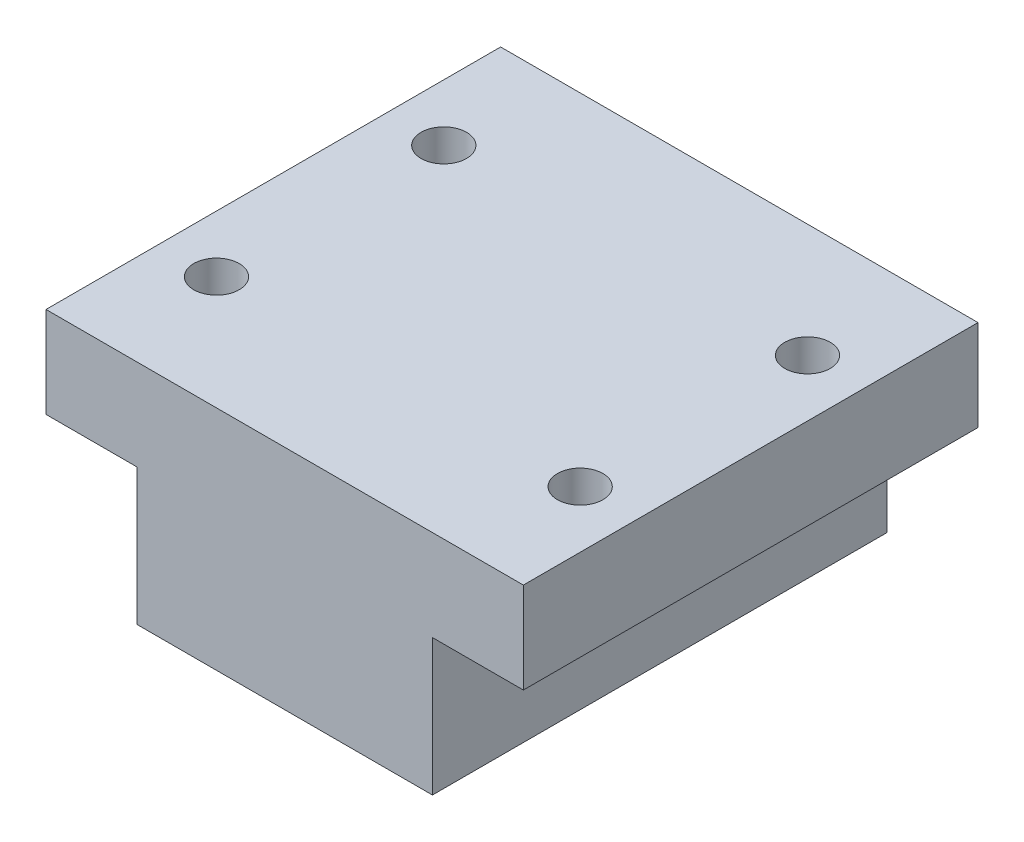
ISO-10303-21;
HEADER;
FILE_DESCRIPTION(('STEP AP214'),'2;1');
FILE_NAME('part.step','',(''),(''),'','','');
FILE_SCHEMA(('AUTOMOTIVE_DESIGN { 1 0 10303 214 1 1 1 1 }'));
ENDSEC;
DATA;
#1=APPLICATION_CONTEXT('core data for automotive mechanical design processes');
#2=APPLICATION_PROTOCOL_DEFINITION('international standard','automotive_design',2000,#1);
#3=PRODUCT_CONTEXT('',#1,'mechanical');
#4=PRODUCT('Part','Part','',(#3));
#5=PRODUCT_RELATED_PRODUCT_CATEGORY('part','',(#4));
#6=PRODUCT_DEFINITION_FORMATION('','',#4);
#7=PRODUCT_DEFINITION_CONTEXT('part definition',#1,'design');
#8=PRODUCT_DEFINITION('design','',#6,#7);
#9=PRODUCT_DEFINITION_SHAPE('','',#8);
#10=(LENGTH_UNIT() NAMED_UNIT(*) SI_UNIT(.MILLI.,.METRE.));
#11=(NAMED_UNIT(*) PLANE_ANGLE_UNIT() SI_UNIT($,.RADIAN.));
#12=(NAMED_UNIT(*) SI_UNIT($,.STERADIAN.) SOLID_ANGLE_UNIT());
#13=UNCERTAINTY_MEASURE_WITH_UNIT(LENGTH_MEASURE(1.E-05),#10,'distance_accuracy_value','');
#14=(GEOMETRIC_REPRESENTATION_CONTEXT(3) GLOBAL_UNCERTAINTY_ASSIGNED_CONTEXT((#13)) GLOBAL_UNIT_ASSIGNED_CONTEXT((#10,
#11,#12)) REPRESENTATION_CONTEXT('',''));
#15=CARTESIAN_POINT('',(0.,0.,0.));
#16=DIRECTION('',(0.,0.,1.));
#17=DIRECTION('',(1.,0.,0.));
#18=AXIS2_PLACEMENT_3D('',#15,#16,#17);
#19=CARTESIAN_POINT('',(21.,-4.,20.));
#20=DIRECTION('',(-1.,0.,0.));
#21=DIRECTION('',(0.,0.,1.));
#22=AXIS2_PLACEMENT_3D('',#19,#20,#21);
#23=PLANE('',#22);
#24=DIRECTION('',(0.,1.,0.));
#25=VECTOR('',#24,1.);
#26=CARTESIAN_POINT('',(21.,-4.,-20.));
#27=LINE('',#26,#25);
#28=CARTESIAN_POINT('',(21.,-4.,-20.));
#29=VERTEX_POINT('',#28);
#30=CARTESIAN_POINT('',(21.,4.,-20.));
#31=VERTEX_POINT('',#30);
#32=EDGE_CURVE('E130',#29,#31,#27,.T.);
#33=ORIENTED_EDGE('',*,*,#32,.T.);
#34=DIRECTION('',(0.,0.,-1.));
#35=VECTOR('',#34,1.);
#36=CARTESIAN_POINT('',(21.,4.,20.));
#37=LINE('',#36,#35);
#38=CARTESIAN_POINT('',(21.,4.,20.));
#39=VERTEX_POINT('',#38);
#40=EDGE_CURVE('E11',#39,#31,#37,.T.);
#41=ORIENTED_EDGE('',*,*,#40,.F.);
#42=DIRECTION('',(0.,1.,0.));
#43=VECTOR('',#42,1.);
#44=CARTESIAN_POINT('',(21.,-4.,20.));
#45=LINE('',#44,#43);
#46=CARTESIAN_POINT('',(21.,-4.,20.));
#47=VERTEX_POINT('',#46);
#48=EDGE_CURVE('E144',#47,#39,#45,.T.);
#49=ORIENTED_EDGE('',*,*,#48,.F.);
#50=DIRECTION('',(0.,0.,-1.));
#51=VECTOR('',#50,1.);
#52=CARTESIAN_POINT('',(21.,-4.,20.));
#53=LINE('',#52,#51);
#54=EDGE_CURVE('E126',#47,#29,#53,.T.);
#55=ORIENTED_EDGE('',*,*,#54,.T.);
#56=EDGE_LOOP('',(#33,#41,#49,#55));
#57=FACE_BOUND('',#56,.T.);
#58=ADVANCED_FACE('F32',(#57),#23,.F.);
#59=CARTESIAN_POINT('',(-21.,4.,20.));
#60=DIRECTION('',(0.,-1.,0.));
#61=DIRECTION('',(0.,0.,-1.));
#62=AXIS2_PLACEMENT_3D('',#59,#60,#61);
#63=PLANE('',#62);
#64=CARTESIAN_POINT('',(16.,4.,-10.));
#65=DIRECTION('',(0.,1.,0.));
#66=DIRECTION('',(0.,0.,1.));
#67=AXIS2_PLACEMENT_3D('',#64,#65,#66);
#68=CIRCLE('',#67,2.);
#69=CARTESIAN_POINT('',(16.,4.,-8.));
#70=VERTEX_POINT('',#69);
#71=EDGE_CURVE('E217',#70,#70,#68,.T.);
#72=ORIENTED_EDGE('',*,*,#71,.F.);
#73=EDGE_LOOP('',(#72));
#74=FACE_BOUND('',#73,.T.);
#75=CARTESIAN_POINT('',(-16.,4.,10.));
#76=DIRECTION('',(0.,1.,0.));
#77=DIRECTION('',(0.,0.,1.));
#78=AXIS2_PLACEMENT_3D('',#75,#76,#77);
#79=CIRCLE('',#78,2.);
#80=CARTESIAN_POINT('',(-16.,4.,12.));
#81=VERTEX_POINT('',#80);
#82=EDGE_CURVE('E218',#81,#81,#79,.T.);
#83=ORIENTED_EDGE('',*,*,#82,.F.);
#84=EDGE_LOOP('',(#83));
#85=FACE_BOUND('',#84,.T.);
#86=CARTESIAN_POINT('',(16.,4.,10.));
#87=DIRECTION('',(0.,1.,0.));
#88=DIRECTION('',(0.,0.,1.));
#89=AXIS2_PLACEMENT_3D('',#86,#87,#88);
#90=CIRCLE('',#89,2.);
#91=CARTESIAN_POINT('',(16.,4.,12.));
#92=VERTEX_POINT('',#91);
#93=EDGE_CURVE('E220',#92,#92,#90,.T.);
#94=ORIENTED_EDGE('',*,*,#93,.F.);
#95=EDGE_LOOP('',(#94));
#96=FACE_BOUND('',#95,.T.);
#97=CARTESIAN_POINT('',(-16.,4.,-10.));
#98=DIRECTION('',(0.,1.,0.));
#99=DIRECTION('',(0.,0.,1.));
#100=AXIS2_PLACEMENT_3D('',#97,#98,#99);
#101=CIRCLE('',#100,2.);
#102=CARTESIAN_POINT('',(-16.,4.,-8.));
#103=VERTEX_POINT('',#102);
#104=EDGE_CURVE('E160',#103,#103,#101,.T.);
#105=ORIENTED_EDGE('',*,*,#104,.F.);
#106=EDGE_LOOP('',(#105));
#107=FACE_BOUND('',#106,.T.);
#108=DIRECTION('',(-1.,0.,0.));
#109=VECTOR('',#108,1.);
#110=CARTESIAN_POINT('',(-21.,4.,-20.));
#111=LINE('',#110,#109);
#112=CARTESIAN_POINT('',(-21.,4.,-20.));
#113=VERTEX_POINT('',#112);
#114=EDGE_CURVE('E133',#31,#113,#111,.T.);
#115=ORIENTED_EDGE('',*,*,#114,.T.);
#116=DIRECTION('',(0.,0.,-1.));
#117=VECTOR('',#116,1.);
#118=CARTESIAN_POINT('',(-21.,4.,20.));
#119=LINE('',#118,#117);
#120=CARTESIAN_POINT('',(-21.,4.,20.));
#121=VERTEX_POINT('',#120);
#122=EDGE_CURVE('E41',#121,#113,#119,.T.);
#123=ORIENTED_EDGE('',*,*,#122,.F.);
#124=DIRECTION('',(-1.,0.,0.));
#125=VECTOR('',#124,1.);
#126=CARTESIAN_POINT('',(-21.,4.,20.));
#127=LINE('',#126,#125);
#128=EDGE_CURVE('E93',#39,#121,#127,.T.);
#129=ORIENTED_EDGE('',*,*,#128,.F.);
#130=ORIENTED_EDGE('',*,*,#40,.T.);
#131=EDGE_LOOP('',(#115,#123,#129,#130));
#132=FACE_BOUND('',#131,.T.);
#133=ADVANCED_FACE('F190',(#74,#85,#96,#107,#132),#63,.F.);
#134=CARTESIAN_POINT('',(-21.,-4.,20.));
#135=DIRECTION('',(1.,0.,0.));
#136=DIRECTION('',(0.,0.,-1.));
#137=AXIS2_PLACEMENT_3D('',#134,#135,#136);
#138=PLANE('',#137);
#139=DIRECTION('',(0.,-1.,0.));
#140=VECTOR('',#139,1.);
#141=CARTESIAN_POINT('',(-21.,-4.,-20.));
#142=LINE('',#141,#140);
#143=CARTESIAN_POINT('',(-21.,-4.,-20.));
#144=VERTEX_POINT('',#143);
#145=EDGE_CURVE('E135',#113,#144,#142,.T.);
#146=ORIENTED_EDGE('',*,*,#145,.T.);
#147=DIRECTION('',(0.,0.,-1.));
#148=VECTOR('',#147,1.);
#149=CARTESIAN_POINT('',(-21.,-4.,20.));
#150=LINE('',#149,#148);
#151=CARTESIAN_POINT('',(-21.,-4.,20.));
#152=VERTEX_POINT('',#151);
#153=EDGE_CURVE('E151',#152,#144,#150,.T.);
#154=ORIENTED_EDGE('',*,*,#153,.F.);
#155=DIRECTION('',(0.,-1.,0.));
#156=VECTOR('',#155,1.);
#157=CARTESIAN_POINT('',(-21.,-4.,20.));
#158=LINE('',#157,#156);
#159=EDGE_CURVE('E207',#121,#152,#158,.T.);
#160=ORIENTED_EDGE('',*,*,#159,.F.);
#161=ORIENTED_EDGE('',*,*,#122,.T.);
#162=EDGE_LOOP('',(#146,#154,#160,#161));
#163=FACE_BOUND('',#162,.T.);
#164=ADVANCED_FACE('F195',(#163),#138,.F.);
#165=CARTESIAN_POINT('',(-21.,-4.,20.));
#166=DIRECTION('',(0.,1.,0.));
#167=DIRECTION('',(-1.,0.,0.));
#168=AXIS2_PLACEMENT_3D('',#165,#166,#167);
#169=PLANE('',#168);
#170=CARTESIAN_POINT('',(-16.,-4.,10.));
#171=DIRECTION('',(0.,1.,0.));
#172=DIRECTION('',(-1.,0.,0.));
#173=AXIS2_PLACEMENT_3D('',#170,#171,#172);
#174=CIRCLE('',#173,2.);
#175=CARTESIAN_POINT('',(-18.,-4.,10.));
#176=VERTEX_POINT('',#175);
#177=EDGE_CURVE('E35',#176,#176,#174,.T.);
#178=ORIENTED_EDGE('',*,*,#177,.T.);
#179=EDGE_LOOP('',(#178));
#180=FACE_BOUND('',#179,.T.);
#181=CARTESIAN_POINT('',(-16.,-4.,-10.));
#182=DIRECTION('',(0.,1.,0.));
#183=DIRECTION('',(-1.,0.,0.));
#184=AXIS2_PLACEMENT_3D('',#181,#182,#183);
#185=CIRCLE('',#184,2.);
#186=CARTESIAN_POINT('',(-18.,-4.,-10.));
#187=VERTEX_POINT('',#186);
#188=EDGE_CURVE('E162',#187,#187,#185,.T.);
#189=ORIENTED_EDGE('',*,*,#188,.T.);
#190=EDGE_LOOP('',(#189));
#191=FACE_BOUND('',#190,.T.);
#192=DIRECTION('',(1.,0.,0.));
#193=VECTOR('',#192,1.);
#194=CARTESIAN_POINT('',(-21.,-4.,-20.));
#195=LINE('',#194,#193);
#196=CARTESIAN_POINT('',(-13.,-4.,-20.));
#197=VERTEX_POINT('',#196);
#198=EDGE_CURVE('E137',#144,#197,#195,.T.);
#199=ORIENTED_EDGE('',*,*,#198,.T.);
#200=DIRECTION('',(0.,0.,-1.));
#201=VECTOR('',#200,1.);
#202=CARTESIAN_POINT('',(-13.,-4.,20.));
#203=LINE('',#202,#201);
#204=CARTESIAN_POINT('',(-13.,-4.,20.));
#205=VERTEX_POINT('',#204);
#206=EDGE_CURVE('E148',#205,#197,#203,.T.);
#207=ORIENTED_EDGE('',*,*,#206,.F.);
#208=DIRECTION('',(1.,0.,0.));
#209=VECTOR('',#208,1.);
#210=CARTESIAN_POINT('',(-21.,-4.,20.));
#211=LINE('',#210,#209);
#212=EDGE_CURVE('E209',#152,#205,#211,.T.);
#213=ORIENTED_EDGE('',*,*,#212,.F.);
#214=ORIENTED_EDGE('',*,*,#153,.T.);
#215=EDGE_LOOP('',(#199,#207,#213,#214));
#216=FACE_BOUND('',#215,.T.);
#217=ADVANCED_FACE('F169',(#180,#191,#216),#169,.F.);
#218=CARTESIAN_POINT('',(-13.,-4.,20.));
#219=DIRECTION('',(1.,0.,0.));
#220=DIRECTION('',(0.,1.,0.));
#221=AXIS2_PLACEMENT_3D('',#218,#219,#220);
#222=PLANE('',#221);
#223=DIRECTION('',(0.,-1.,0.));
#224=VECTOR('',#223,1.);
#225=CARTESIAN_POINT('',(-13.,-4.,-20.));
#226=LINE('',#225,#224);
#227=CARTESIAN_POINT('',(-13.,-16.,-20.));
#228=VERTEX_POINT('',#227);
#229=EDGE_CURVE('E139',#197,#228,#226,.T.);
#230=ORIENTED_EDGE('',*,*,#229,.T.);
#231=DIRECTION('',(0.,0.,-1.));
#232=VECTOR('',#231,1.);
#233=CARTESIAN_POINT('',(-13.,-16.,20.));
#234=LINE('',#233,#232);
#235=CARTESIAN_POINT('',(-13.,-16.,20.));
#236=VERTEX_POINT('',#235);
#237=EDGE_CURVE('E121',#236,#228,#234,.T.);
#238=ORIENTED_EDGE('',*,*,#237,.F.);
#239=DIRECTION('',(0.,-1.,0.));
#240=VECTOR('',#239,1.);
#241=CARTESIAN_POINT('',(-13.,-4.,20.));
#242=LINE('',#241,#240);
#243=EDGE_CURVE('E112',#205,#236,#242,.T.);
#244=ORIENTED_EDGE('',*,*,#243,.F.);
#245=ORIENTED_EDGE('',*,*,#206,.T.);
#246=EDGE_LOOP('',(#230,#238,#244,#245));
#247=FACE_BOUND('',#246,.T.);
#248=ADVANCED_FACE('F236',(#247),#222,.F.);
#249=CARTESIAN_POINT('',(13.,-16.,20.));
#250=DIRECTION('',(0.,1.,0.));
#251=DIRECTION('',(-1.,0.,0.));
#252=AXIS2_PLACEMENT_3D('',#249,#250,#251);
#253=PLANE('',#252);
#254=CARTESIAN_POINT('',(0.,-16.,-4.5));
#255=DIRECTION('',(0.,-1.,0.));
#256=DIRECTION('',(1.,0.,0.));
#257=AXIS2_PLACEMENT_3D('',#254,#255,#256);
#258=CIRCLE('',#257,5.5);
#259=CARTESIAN_POINT('',(5.5,-16.,-4.5));
#260=VERTEX_POINT('',#259);
#261=EDGE_CURVE('E226',#260,#260,#258,.T.);
#262=ORIENTED_EDGE('',*,*,#261,.F.);
#263=EDGE_LOOP('',(#262));
#264=FACE_BOUND('',#263,.T.);
#265=DIRECTION('',(1.,0.,0.));
#266=VECTOR('',#265,1.);
#267=CARTESIAN_POINT('',(13.,-16.,-20.));
#268=LINE('',#267,#266);
#269=CARTESIAN_POINT('',(13.,-16.,-20.));
#270=VERTEX_POINT('',#269);
#271=EDGE_CURVE('E120',#228,#270,#268,.T.);
#272=ORIENTED_EDGE('',*,*,#271,.T.);
#273=DIRECTION('',(0.,0.,-1.));
#274=VECTOR('',#273,1.);
#275=CARTESIAN_POINT('',(13.,-16.,20.));
#276=LINE('',#275,#274);
#277=CARTESIAN_POINT('',(13.,-16.,20.));
#278=VERTEX_POINT('',#277);
#279=EDGE_CURVE('E117',#278,#270,#276,.T.);
#280=ORIENTED_EDGE('',*,*,#279,.F.);
#281=DIRECTION('',(1.,0.,0.));
#282=VECTOR('',#281,1.);
#283=CARTESIAN_POINT('',(13.,-16.,20.));
#284=LINE('',#283,#282);
#285=EDGE_CURVE('E106',#236,#278,#284,.T.);
#286=ORIENTED_EDGE('',*,*,#285,.F.);
#287=ORIENTED_EDGE('',*,*,#237,.T.);
#288=EDGE_LOOP('',(#272,#280,#286,#287));
#289=FACE_BOUND('',#288,.T.);
#290=ADVANCED_FACE('F118',(#264,#289),#253,.F.);
#291=CARTESIAN_POINT('',(13.,-4.,20.));
#292=DIRECTION('',(-1.,0.,0.));
#293=DIRECTION('',(0.,0.,1.));
#294=AXIS2_PLACEMENT_3D('',#291,#292,#293);
#295=PLANE('',#294);
#296=DIRECTION('',(0.,1.,0.));
#297=VECTOR('',#296,1.);
#298=CARTESIAN_POINT('',(13.,-4.,-20.));
#299=LINE('',#298,#297);
#300=CARTESIAN_POINT('',(13.,-4.,-20.));
#301=VERTEX_POINT('',#300);
#302=EDGE_CURVE('E79',#270,#301,#299,.T.);
#303=ORIENTED_EDGE('',*,*,#302,.T.);
#304=DIRECTION('',(0.,0.,-1.));
#305=VECTOR('',#304,1.);
#306=CARTESIAN_POINT('',(13.,-4.,20.));
#307=LINE('',#306,#305);
#308=CARTESIAN_POINT('',(13.,-4.,20.));
#309=VERTEX_POINT('',#308);
#310=EDGE_CURVE('E122',#309,#301,#307,.T.);
#311=ORIENTED_EDGE('',*,*,#310,.F.);
#312=DIRECTION('',(0.,1.,0.));
#313=VECTOR('',#312,1.);
#314=CARTESIAN_POINT('',(13.,-4.,20.));
#315=LINE('',#314,#313);
#316=EDGE_CURVE('E110',#278,#309,#315,.T.);
#317=ORIENTED_EDGE('',*,*,#316,.F.);
#318=ORIENTED_EDGE('',*,*,#279,.T.);
#319=EDGE_LOOP('',(#303,#311,#317,#318));
#320=FACE_BOUND('',#319,.T.);
#321=ADVANCED_FACE('F124',(#320),#295,.F.);
#322=CARTESIAN_POINT('',(13.,-4.,20.));
#323=DIRECTION('',(0.,1.,0.));
#324=DIRECTION('',(-1.,0.,0.));
#325=AXIS2_PLACEMENT_3D('',#322,#323,#324);
#326=PLANE('',#325);
#327=CARTESIAN_POINT('',(16.,-4.,-10.));
#328=DIRECTION('',(0.,1.,0.));
#329=DIRECTION('',(-1.,0.,0.));
#330=AXIS2_PLACEMENT_3D('',#327,#328,#329);
#331=CIRCLE('',#330,2.);
#332=CARTESIAN_POINT('',(14.,-4.,-10.));
#333=VERTEX_POINT('',#332);
#334=EDGE_CURVE('E159',#333,#333,#331,.T.);
#335=ORIENTED_EDGE('',*,*,#334,.T.);
#336=EDGE_LOOP('',(#335));
#337=FACE_BOUND('',#336,.T.);
#338=CARTESIAN_POINT('',(16.,-4.,10.));
#339=DIRECTION('',(0.,1.,0.));
#340=DIRECTION('',(-1.,0.,0.));
#341=AXIS2_PLACEMENT_3D('',#338,#339,#340);
#342=CIRCLE('',#341,2.);
#343=CARTESIAN_POINT('',(14.,-4.,10.));
#344=VERTEX_POINT('',#343);
#345=EDGE_CURVE('E156',#344,#344,#342,.T.);
#346=ORIENTED_EDGE('',*,*,#345,.T.);
#347=EDGE_LOOP('',(#346));
#348=FACE_BOUND('',#347,.T.);
#349=DIRECTION('',(1.,0.,0.));
#350=VECTOR('',#349,1.);
#351=CARTESIAN_POINT('',(13.,-4.,-20.));
#352=LINE('',#351,#350);
#353=EDGE_CURVE('E85',#301,#29,#352,.T.);
#354=ORIENTED_EDGE('',*,*,#353,.T.);
#355=ORIENTED_EDGE('',*,*,#54,.F.);
#356=DIRECTION('',(1.,0.,0.));
#357=VECTOR('',#356,1.);
#358=CARTESIAN_POINT('',(13.,-4.,20.));
#359=LINE('',#358,#357);
#360=EDGE_CURVE('E50',#309,#47,#359,.T.);
#361=ORIENTED_EDGE('',*,*,#360,.F.);
#362=ORIENTED_EDGE('',*,*,#310,.T.);
#363=EDGE_LOOP('',(#354,#355,#361,#362));
#364=FACE_BOUND('',#363,.T.);
#365=ADVANCED_FACE('F242',(#337,#348,#364),#326,.F.);
#366=CARTESIAN_POINT('',(0.,0.,20.));
#367=DIRECTION('',(0.,0.,-1.));
#368=DIRECTION('',(-1.,0.,0.));
#369=AXIS2_PLACEMENT_3D('',#366,#367,#368);
#370=PLANE('',#369);
#371=ORIENTED_EDGE('',*,*,#48,.T.);
#372=ORIENTED_EDGE('',*,*,#128,.T.);
#373=ORIENTED_EDGE('',*,*,#159,.T.);
#374=ORIENTED_EDGE('',*,*,#212,.T.);
#375=ORIENTED_EDGE('',*,*,#243,.T.);
#376=ORIENTED_EDGE('',*,*,#285,.T.);
#377=ORIENTED_EDGE('',*,*,#316,.T.);
#378=ORIENTED_EDGE('',*,*,#360,.T.);
#379=EDGE_LOOP('',(#371,#372,#373,#374,#375,#376,#377,#378));
#380=FACE_BOUND('',#379,.T.);
#381=ADVANCED_FACE('F108',(#380),#370,.F.);
#382=CARTESIAN_POINT('',(0.,0.,-20.));
#383=DIRECTION('',(0.,0.,-1.));
#384=DIRECTION('',(-1.,0.,0.));
#385=AXIS2_PLACEMENT_3D('',#382,#383,#384);
#386=PLANE('',#385);
#387=ORIENTED_EDGE('',*,*,#32,.F.);
#388=ORIENTED_EDGE('',*,*,#353,.F.);
#389=ORIENTED_EDGE('',*,*,#302,.F.);
#390=ORIENTED_EDGE('',*,*,#271,.F.);
#391=ORIENTED_EDGE('',*,*,#229,.F.);
#392=ORIENTED_EDGE('',*,*,#198,.F.);
#393=ORIENTED_EDGE('',*,*,#145,.F.);
#394=ORIENTED_EDGE('',*,*,#114,.F.);
#395=EDGE_LOOP('',(#387,#388,#389,#390,#391,#392,#393,#394));
#396=FACE_BOUND('',#395,.T.);
#397=ADVANCED_FACE('F201',(#396),#386,.T.);
#398=CARTESIAN_POINT('',(16.,-36.,10.));
#399=DIRECTION('',(0.,1.,0.));
#400=DIRECTION('',(0.,0.,1.));
#401=AXIS2_PLACEMENT_3D('',#398,#399,#400);
#402=CYLINDRICAL_SURFACE('',#401,2.);
#403=ORIENTED_EDGE('',*,*,#93,.T.);
#404=EDGE_LOOP('',(#403));
#405=FACE_BOUND('',#404,.T.);
#406=ORIENTED_EDGE('',*,*,#345,.F.);
#407=EDGE_LOOP('',(#406));
#408=FACE_BOUND('',#407,.T.);
#409=ADVANCED_FACE('F289',(#405,#408),#402,.F.);
#410=CARTESIAN_POINT('',(16.,-36.,-10.));
#411=DIRECTION('',(0.,1.,0.));
#412=DIRECTION('',(0.,0.,1.));
#413=AXIS2_PLACEMENT_3D('',#410,#411,#412);
#414=CYLINDRICAL_SURFACE('',#413,2.);
#415=ORIENTED_EDGE('',*,*,#71,.T.);
#416=EDGE_LOOP('',(#415));
#417=FACE_BOUND('',#416,.T.);
#418=ORIENTED_EDGE('',*,*,#334,.F.);
#419=EDGE_LOOP('',(#418));
#420=FACE_BOUND('',#419,.T.);
#421=ADVANCED_FACE('F184',(#417,#420),#414,.F.);
#422=CARTESIAN_POINT('',(-16.,-36.,-10.));
#423=DIRECTION('',(0.,1.,0.));
#424=DIRECTION('',(0.,0.,1.));
#425=AXIS2_PLACEMENT_3D('',#422,#423,#424);
#426=CYLINDRICAL_SURFACE('',#425,2.);
#427=ORIENTED_EDGE('',*,*,#104,.T.);
#428=EDGE_LOOP('',(#427));
#429=FACE_BOUND('',#428,.T.);
#430=ORIENTED_EDGE('',*,*,#188,.F.);
#431=EDGE_LOOP('',(#430));
#432=FACE_BOUND('',#431,.T.);
#433=ADVANCED_FACE('F174',(#429,#432),#426,.F.);
#434=CARTESIAN_POINT('',(-16.,-36.,10.));
#435=DIRECTION('',(0.,1.,0.));
#436=DIRECTION('',(0.,0.,1.));
#437=AXIS2_PLACEMENT_3D('',#434,#435,#436);
#438=CYLINDRICAL_SURFACE('',#437,2.);
#439=ORIENTED_EDGE('',*,*,#82,.T.);
#440=EDGE_LOOP('',(#439));
#441=FACE_BOUND('',#440,.T.);
#442=ORIENTED_EDGE('',*,*,#177,.F.);
#443=EDGE_LOOP('',(#442));
#444=FACE_BOUND('',#443,.T.);
#445=ADVANCED_FACE('F171',(#441,#444),#438,.F.);
#446=CARTESIAN_POINT('',(0.,-14.25,-4.5));
#447=DIRECTION('',(0.,-1.,0.));
#448=DIRECTION('',(1.,0.,0.));
#449=AXIS2_PLACEMENT_3D('',#446,#447,#448);
#450=CYLINDRICAL_SURFACE('',#449,5.5);
#451=CARTESIAN_POINT('',(0.,-14.25,-4.5));
#452=DIRECTION('',(0.,-1.,0.));
#453=DIRECTION('',(1.,0.,0.));
#454=AXIS2_PLACEMENT_3D('',#451,#452,#453);
#455=CIRCLE('',#454,5.5);
#456=CARTESIAN_POINT('',(5.5,-14.25,-4.5));
#457=VERTEX_POINT('',#456);
#458=EDGE_CURVE('E225',#457,#457,#455,.T.);
#459=ORIENTED_EDGE('',*,*,#458,.F.);
#460=EDGE_LOOP('',(#459));
#461=FACE_BOUND('',#460,.T.);
#462=ORIENTED_EDGE('',*,*,#261,.T.);
#463=EDGE_LOOP('',(#462));
#464=FACE_BOUND('',#463,.T.);
#465=ADVANCED_FACE('F173',(#461,#464),#450,.F.);
#466=CARTESIAN_POINT('',(0.,-14.25,-4.5));
#467=DIRECTION('',(0.,-1.,0.));
#468=DIRECTION('',(1.,0.,0.));
#469=AXIS2_PLACEMENT_3D('',#466,#467,#468);
#470=PLANE('',#469);
#471=ORIENTED_EDGE('',*,*,#458,.T.);
#472=EDGE_LOOP('',(#471));
#473=FACE_BOUND('',#472,.T.);
#474=ADVANCED_FACE('F181',(#473),#470,.T.);
#475=CLOSED_SHELL('',(#58,#133,#164,#217,#248,#290,#321,#365,#381,#397,#409,#421,#433,#445,#465,#474));
#476=MANIFOLD_SOLID_BREP('B2',#475);
#477=ADVANCED_BREP_SHAPE_REPRESENTATION('',(#18,#476),#14);
#478=SHAPE_DEFINITION_REPRESENTATION(#9,#477);
ENDSEC;
END-ISO-10303-21;
